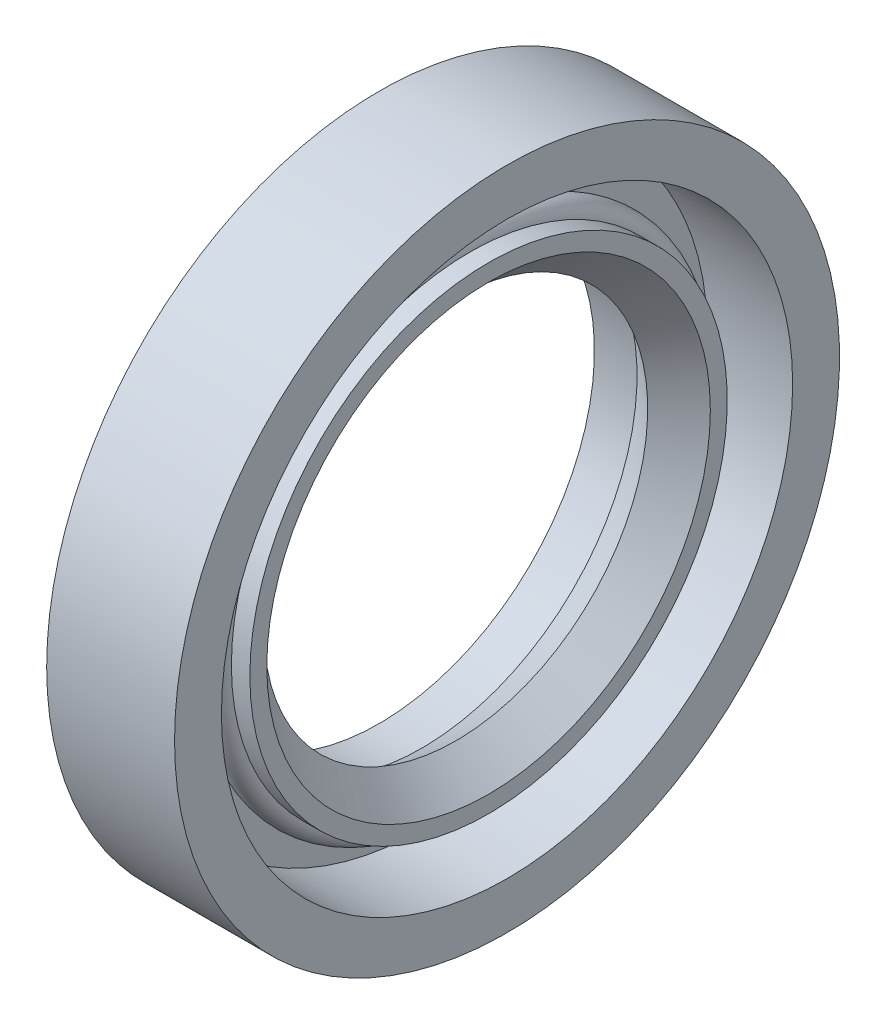
ISO-10303-21;
HEADER;
FILE_DESCRIPTION(('STEP AP214'),'2;1');
FILE_NAME('part.step','',(''),(''),'','','');
FILE_SCHEMA(('AUTOMOTIVE_DESIGN { 1 0 10303 214 1 1 1 1 }'));
ENDSEC;
DATA;
#1=APPLICATION_CONTEXT('core data for automotive mechanical design processes');
#2=APPLICATION_PROTOCOL_DEFINITION('international standard','automotive_design',2000,#1);
#3=PRODUCT_CONTEXT('',#1,'mechanical');
#4=PRODUCT('Part','Part','',(#3));
#5=PRODUCT_RELATED_PRODUCT_CATEGORY('part','',(#4));
#6=PRODUCT_DEFINITION_FORMATION('','',#4);
#7=PRODUCT_DEFINITION_CONTEXT('part definition',#1,'design');
#8=PRODUCT_DEFINITION('design','',#6,#7);
#9=PRODUCT_DEFINITION_SHAPE('','',#8);
#10=(LENGTH_UNIT() NAMED_UNIT(*) SI_UNIT(.MILLI.,.METRE.));
#11=(NAMED_UNIT(*) PLANE_ANGLE_UNIT() SI_UNIT($,.RADIAN.));
#12=(NAMED_UNIT(*) SI_UNIT($,.STERADIAN.) SOLID_ANGLE_UNIT());
#13=UNCERTAINTY_MEASURE_WITH_UNIT(LENGTH_MEASURE(1.E-05),#10,'distance_accuracy_value','');
#14=(GEOMETRIC_REPRESENTATION_CONTEXT(3) GLOBAL_UNCERTAINTY_ASSIGNED_CONTEXT((#13)) GLOBAL_UNIT_ASSIGNED_CONTEXT((#10,
#11,#12)) REPRESENTATION_CONTEXT('',''));
#15=CARTESIAN_POINT('',(0.,0.,0.));
#16=DIRECTION('',(0.,0.,1.));
#17=DIRECTION('',(1.,0.,0.));
#18=AXIS2_PLACEMENT_3D('',#15,#16,#17);
#19=CARTESIAN_POINT('',(0.,-26.4829849373124,-26.));
#20=DIRECTION('',(-1.,0.,0.));
#21=DIRECTION('',(0.,0.,1.));
#22=AXIS2_PLACEMENT_3D('',#19,#20,#21);
#23=PLANE('',#22);
#24=CARTESIAN_POINT('',(0.,0.,0.));
#25=DIRECTION('',(-1.,0.,0.));
#26=DIRECTION('',(0.,0.,-1.));
#27=AXIS2_PLACEMENT_3D('',#24,#25,#26);
#28=CIRCLE('',#27,26.);
#29=CARTESIAN_POINT('',(0.,0.,-26.));
#30=VERTEX_POINT('',#29);
#31=EDGE_CURVE('E67',#30,#30,#28,.F.);
#32=ORIENTED_EDGE('',*,*,#31,.F.);
#33=EDGE_LOOP('',(#32));
#34=FACE_BOUND('',#33,.T.);
#35=CARTESIAN_POINT('',(0.,0.,0.));
#36=DIRECTION('',(1.,0.,0.));
#37=DIRECTION('',(0.,-1.16838214351016E-09,1.));
#38=AXIS2_PLACEMENT_3D('',#35,#36,#37);
#39=CIRCLE('',#38,16.833333333333);
#40=CARTESIAN_POINT('',(0.,-1.96677660824207E-08,16.833333333333));
#41=VERTEX_POINT('',#40);
#42=EDGE_CURVE('E63',#41,#41,#39,.T.);
#43=ORIENTED_EDGE('',*,*,#42,.T.);
#44=EDGE_LOOP('',(#43));
#45=FACE_BOUND('',#44,.T.);
#46=ADVANCED_FACE('F14',(#34,#45),#23,.T.);
#47=CARTESIAN_POINT('',(8.5555555,-19.0134250507242,18.666666666667));
#48=DIRECTION('',(1.,0.,0.));
#49=DIRECTION('',(0.,0.,-1.));
#50=AXIS2_PLACEMENT_3D('',#47,#48,#49);
#51=PLANE('',#50);
#52=CARTESIAN_POINT('',(8.5555555,0.,0.));
#53=DIRECTION('',(1.,0.,0.));
#54=DIRECTION('',(0.,-1.16846113737014E-09,1.));
#55=AXIS2_PLACEMENT_3D('',#52,#53,#54);
#56=CIRCLE('',#55,18.666666666667);
#57=CARTESIAN_POINT('',(8.5555555,-2.18112745642429E-08,18.666666666667));
#58=VERTEX_POINT('',#57);
#59=EDGE_CURVE('E59',#58,#58,#56,.T.);
#60=ORIENTED_EDGE('',*,*,#59,.T.);
#61=EDGE_LOOP('',(#60));
#62=FACE_BOUND('',#61,.T.);
#63=CARTESIAN_POINT('',(8.5555555,0.,0.));
#64=DIRECTION('',(-1.,0.,0.));
#65=DIRECTION('',(0.,0.,-1.));
#66=AXIS2_PLACEMENT_3D('',#63,#64,#65);
#67=CIRCLE('',#66,17.342592541667);
#68=CARTESIAN_POINT('',(8.5555555,0.,-17.342592541667));
#69=VERTEX_POINT('',#68);
#70=EDGE_CURVE('E55',#69,#69,#67,.F.);
#71=ORIENTED_EDGE('',*,*,#70,.F.);
#72=EDGE_LOOP('',(#71));
#73=FACE_BOUND('',#72,.T.);
#74=ADVANCED_FACE('F77',(#62,#73),#51,.T.);
#75=CARTESIAN_POINT('',(3.3333333333333,-22.7482050102552,22.333333333333));
#76=DIRECTION('',(1.,0.,0.));
#77=DIRECTION('',(0.,0.,-1.));
#78=AXIS2_PLACEMENT_3D('',#75,#76,#77);
#79=PLANE('',#78);
#80=CARTESIAN_POINT('',(3.3333333333333,0.,0.));
#81=DIRECTION('',(1.,0.,0.));
#82=DIRECTION('',(0.,0.,1.));
#83=AXIS2_PLACEMENT_3D('',#80,#81,#82);
#84=CIRCLE('',#83,22.333333333333);
#85=CARTESIAN_POINT('',(3.3333333333333,0.,22.333333333333));
#86=VERTEX_POINT('',#85);
#87=EDGE_CURVE('E51',#86,#86,#84,.T.);
#88=ORIENTED_EDGE('',*,*,#87,.T.);
#89=EDGE_LOOP('',(#88));
#90=FACE_BOUND('',#89,.T.);
#91=CARTESIAN_POINT('',(3.3333333333333,0.,0.));
#92=DIRECTION('',(-1.,0.,0.));
#93=DIRECTION('',(0.,0.,-1.));
#94=AXIS2_PLACEMENT_3D('',#91,#92,#93);
#95=CIRCLE('',#94,18.666666666667);
#96=CARTESIAN_POINT('',(3.3333333333333,0.,-18.666666666667));
#97=VERTEX_POINT('',#96);
#98=EDGE_CURVE('E47',#97,#97,#95,.F.);
#99=ORIENTED_EDGE('',*,*,#98,.F.);
#100=EDGE_LOOP('',(#99));
#101=FACE_BOUND('',#100,.T.);
#102=ADVANCED_FACE('F116',(#90,#101),#79,.T.);
#103=CARTESIAN_POINT('',(10.,-26.4829849373124,26.));
#104=DIRECTION('',(1.,0.,0.));
#105=DIRECTION('',(0.,0.,-1.));
#106=AXIS2_PLACEMENT_3D('',#103,#104,#105);
#107=PLANE('',#106);
#108=CARTESIAN_POINT('',(10.,0.,0.));
#109=DIRECTION('',(1.,0.,0.));
#110=DIRECTION('',(0.,0.,1.));
#111=AXIS2_PLACEMENT_3D('',#108,#109,#110);
#112=CIRCLE('',#111,26.);
#113=CARTESIAN_POINT('',(10.,0.,26.));
#114=VERTEX_POINT('',#113);
#115=EDGE_CURVE('E43',#114,#114,#112,.T.);
#116=ORIENTED_EDGE('',*,*,#115,.T.);
#117=EDGE_LOOP('',(#116));
#118=FACE_BOUND('',#117,.T.);
#119=CARTESIAN_POINT('',(10.,0.,0.));
#120=DIRECTION('',(-1.,0.,0.));
#121=DIRECTION('',(0.,0.,-1.));
#122=AXIS2_PLACEMENT_3D('',#119,#120,#121);
#123=CIRCLE('',#122,22.333333333333);
#124=CARTESIAN_POINT('',(10.,0.,-22.333333333333));
#125=VERTEX_POINT('',#124);
#126=EDGE_CURVE('E39',#125,#125,#123,.F.);
#127=ORIENTED_EDGE('',*,*,#126,.F.);
#128=EDGE_LOOP('',(#127));
#129=FACE_BOUND('',#128,.T.);
#130=ADVANCED_FACE('F94',(#118,#129),#107,.T.);
#131=CARTESIAN_POINT('',(10.,0.,0.));
#132=DIRECTION('',(1.,0.,0.));
#133=DIRECTION('',(0.,0.,1.));
#134=AXIS2_PLACEMENT_3D('',#131,#132,#133);
#135=CYLINDRICAL_SURFACE('',#134,26.);
#136=ORIENTED_EDGE('',*,*,#31,.T.);
#137=EDGE_LOOP('',(#136));
#138=FACE_BOUND('',#137,.T.);
#139=ORIENTED_EDGE('',*,*,#115,.F.);
#140=EDGE_LOOP('',(#139));
#141=FACE_BOUND('',#140,.T.);
#142=ADVANCED_FACE('F72',(#138,#141),#135,.T.);
#143=CARTESIAN_POINT('',(10.,0.,0.));
#144=DIRECTION('',(1.,0.,0.));
#145=DIRECTION('',(0.,0.,1.));
#146=AXIS2_PLACEMENT_3D('',#143,#144,#145);
#147=CYLINDRICAL_SURFACE('',#146,16.833333333333);
#148=CARTESIAN_POINT('',(3.3333333333333,0.,0.));
#149=DIRECTION('',(1.,0.,0.));
#150=DIRECTION('',(0.,0.,1.));
#151=AXIS2_PLACEMENT_3D('',#148,#149,#150);
#152=CIRCLE('',#151,16.833333333333);
#153=CARTESIAN_POINT('',(3.3333333333333,0.,16.833333333333));
#154=VERTEX_POINT('',#153);
#155=EDGE_CURVE('E33',#154,#154,#152,.T.);
#156=ORIENTED_EDGE('',*,*,#155,.T.);
#157=EDGE_LOOP('',(#156));
#158=FACE_BOUND('',#157,.T.);
#159=ORIENTED_EDGE('',*,*,#42,.F.);
#160=EDGE_LOOP('',(#159));
#161=FACE_BOUND('',#160,.T.);
#162=ADVANCED_FACE('F81',(#158,#161),#147,.F.);
#163=CARTESIAN_POINT('',(3.3333333333333,0.,0.));
#164=DIRECTION('',(-1.,0.,0.));
#165=DIRECTION('',(0.,0.,-1.));
#166=AXIS2_PLACEMENT_3D('',#163,#164,#165);
#167=CONICAL_SURFACE('',#166,16.833333333333,0.602287346134873);
#168=ORIENTED_EDGE('',*,*,#155,.F.);
#169=EDGE_LOOP('',(#168));
#170=FACE_BOUND('',#169,.T.);
#171=CARTESIAN_POINT('',(6.,0.,0.));
#172=DIRECTION('',(1.,0.,0.));
#173=DIRECTION('',(0.,0.,1.));
#174=AXIS2_PLACEMENT_3D('',#171,#172,#173);
#175=CIRCLE('',#174,15.);
#176=CARTESIAN_POINT('',(6.,0.,15.));
#177=VERTEX_POINT('',#176);
#178=EDGE_CURVE('E28',#177,#177,#175,.T.);
#179=ORIENTED_EDGE('',*,*,#178,.T.);
#180=EDGE_LOOP('',(#179));
#181=FACE_BOUND('',#180,.T.);
#182=ADVANCED_FACE('F83',(#170,#181),#167,.F.);
#183=CARTESIAN_POINT('',(8.5555555,0.,0.));
#184=DIRECTION('',(1.,0.,0.));
#185=DIRECTION('',(0.,1.16849608911715E-09,1.));
#186=AXIS2_PLACEMENT_3D('',#183,#184,#185);
#187=CONICAL_SURFACE('',#186,17.342592541667,0.741947268005987);
#188=ORIENTED_EDGE('',*,*,#70,.T.);
#189=EDGE_LOOP('',(#188));
#190=FACE_BOUND('',#189,.T.);
#191=ORIENTED_EDGE('',*,*,#178,.F.);
#192=EDGE_LOOP('',(#191));
#193=FACE_BOUND('',#192,.T.);
#194=ADVANCED_FACE('F91',(#190,#193),#187,.F.);
#195=CARTESIAN_POINT('',(10.,0.,0.));
#196=DIRECTION('',(1.,0.,0.));
#197=DIRECTION('',(0.,0.,1.));
#198=AXIS2_PLACEMENT_3D('',#195,#196,#197);
#199=CYLINDRICAL_SURFACE('',#198,18.666666666667);
#200=CARTESIAN_POINT('',(7.111111,0.,0.));
#201=DIRECTION('',(1.,0.,0.));
#202=DIRECTION('',(0.,0.,1.));
#203=AXIS2_PLACEMENT_3D('',#200,#201,#202);
#204=CIRCLE('',#203,18.666666666667);
#205=CARTESIAN_POINT('',(7.111111,0.,18.666666666667));
#206=VERTEX_POINT('',#205);
#207=EDGE_CURVE('E22',#206,#206,#204,.T.);
#208=ORIENTED_EDGE('',*,*,#207,.T.);
#209=EDGE_LOOP('',(#208));
#210=FACE_BOUND('',#209,.T.);
#211=ORIENTED_EDGE('',*,*,#59,.F.);
#212=EDGE_LOOP('',(#211));
#213=FACE_BOUND('',#212,.T.);
#214=ADVANCED_FACE('F100',(#210,#213),#199,.T.);
#215=CARTESIAN_POINT('',(6.,0.,0.));
#216=DIRECTION('',(1.,0.,0.));
#217=DIRECTION('',(0.,0.,1.));
#218=AXIS2_PLACEMENT_3D('',#215,#216,#217);
#219=TOROIDAL_SURFACE('',#218,18.666666666667,1.111111);
#220=CARTESIAN_POINT('',(4.888889,0.,0.));
#221=DIRECTION('',(1.,0.,0.));
#222=DIRECTION('',(0.,0.,1.));
#223=AXIS2_PLACEMENT_3D('',#220,#221,#222);
#224=CIRCLE('',#223,18.666666666667);
#225=CARTESIAN_POINT('',(4.888889,0.,18.666666666667));
#226=VERTEX_POINT('',#225);
#227=EDGE_CURVE('E9',#226,#226,#224,.T.);
#228=ORIENTED_EDGE('',*,*,#227,.T.);
#229=EDGE_LOOP('',(#228));
#230=FACE_BOUND('',#229,.T.);
#231=ORIENTED_EDGE('',*,*,#207,.F.);
#232=EDGE_LOOP('',(#231));
#233=FACE_BOUND('',#232,.T.);
#234=ADVANCED_FACE('F104',(#230,#233),#219,.T.);
#235=CARTESIAN_POINT('',(10.,0.,0.));
#236=DIRECTION('',(1.,0.,0.));
#237=DIRECTION('',(0.,0.,1.));
#238=AXIS2_PLACEMENT_3D('',#235,#236,#237);
#239=CYLINDRICAL_SURFACE('',#238,18.666666666667);
#240=ORIENTED_EDGE('',*,*,#98,.T.);
#241=EDGE_LOOP('',(#240));
#242=FACE_BOUND('',#241,.T.);
#243=ORIENTED_EDGE('',*,*,#227,.F.);
#244=EDGE_LOOP('',(#243));
#245=FACE_BOUND('',#244,.T.);
#246=ADVANCED_FACE('F106',(#242,#245),#239,.T.);
#247=CARTESIAN_POINT('',(10.,0.,0.));
#248=DIRECTION('',(1.,0.,0.));
#249=DIRECTION('',(0.,0.,1.));
#250=AXIS2_PLACEMENT_3D('',#247,#248,#249);
#251=CYLINDRICAL_SURFACE('',#250,22.333333333333);
#252=ORIENTED_EDGE('',*,*,#126,.T.);
#253=EDGE_LOOP('',(#252));
#254=FACE_BOUND('',#253,.T.);
#255=ORIENTED_EDGE('',*,*,#87,.F.);
#256=EDGE_LOOP('',(#255));
#257=FACE_BOUND('',#256,.T.);
#258=ADVANCED_FACE('F16',(#254,#257),#251,.F.);
#259=CLOSED_SHELL('',(#46,#74,#102,#130,#142,#162,#182,#194,#214,#234,#246,#258));
#260=MANIFOLD_SOLID_BREP('B1',#259);
#261=ADVANCED_BREP_SHAPE_REPRESENTATION('',(#18,#260),#14);
#262=SHAPE_DEFINITION_REPRESENTATION(#9,#261);
ENDSEC;
END-ISO-10303-21;
